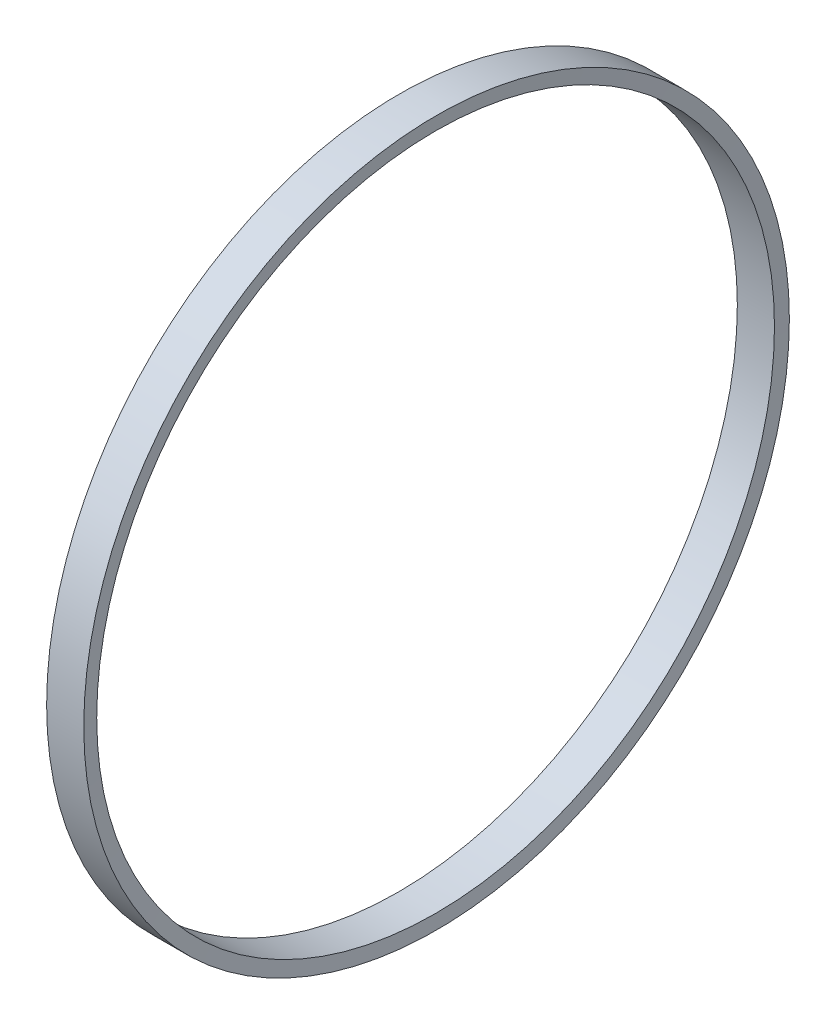
ISO-10303-21;
HEADER;
FILE_DESCRIPTION(('STEP AP214'),'2;1');
FILE_NAME('part.step','',(''),(''),'','','');
FILE_SCHEMA(('AUTOMOTIVE_DESIGN { 1 0 10303 214 1 1 1 1 }'));
ENDSEC;
DATA;
#1=APPLICATION_CONTEXT('core data for automotive mechanical design processes');
#2=APPLICATION_PROTOCOL_DEFINITION('international standard','automotive_design',2000,#1);
#3=PRODUCT_CONTEXT('',#1,'mechanical');
#4=PRODUCT('Part','Part','',(#3));
#5=PRODUCT_RELATED_PRODUCT_CATEGORY('part','',(#4));
#6=PRODUCT_DEFINITION_FORMATION('','',#4);
#7=PRODUCT_DEFINITION_CONTEXT('part definition',#1,'design');
#8=PRODUCT_DEFINITION('design','',#6,#7);
#9=PRODUCT_DEFINITION_SHAPE('','',#8);
#10=(LENGTH_UNIT() NAMED_UNIT(*) SI_UNIT(.MILLI.,.METRE.));
#11=(NAMED_UNIT(*) PLANE_ANGLE_UNIT() SI_UNIT($,.RADIAN.));
#12=(NAMED_UNIT(*) SI_UNIT($,.STERADIAN.) SOLID_ANGLE_UNIT());
#13=UNCERTAINTY_MEASURE_WITH_UNIT(LENGTH_MEASURE(1.E-05),#10,'distance_accuracy_value','');
#14=(GEOMETRIC_REPRESENTATION_CONTEXT(3) GLOBAL_UNCERTAINTY_ASSIGNED_CONTEXT((#13)) GLOBAL_UNIT_ASSIGNED_CONTEXT((#10,
#11,#12)) REPRESENTATION_CONTEXT('',''));
#15=CARTESIAN_POINT('',(0.,0.,0.));
#16=DIRECTION('',(0.,0.,1.));
#17=DIRECTION('',(1.,0.,0.));
#18=AXIS2_PLACEMENT_3D('',#15,#16,#17);
#19=CARTESIAN_POINT('',(-15.7838190834156,2.22044604925031E-13,-3.29360228641095E-13));
#20=DIRECTION('',(1.00000000000002,0.,0.));
#21=DIRECTION('',(0.,0.,-1.));
#22=AXIS2_PLACEMENT_3D('',#19,#20,#21);
#23=CONICAL_SURFACE('',#22,36.5,1.50098315671512);
#24=CARTESIAN_POINT('',(-15.6789288654999,0.,0.));
#25=DIRECTION('',(1.00000000000002,0.,0.));
#26=DIRECTION('',(0.,0.,-1.));
#27=AXIS2_PLACEMENT_3D('',#24,#25,#26);
#28=CIRCLE('',#27,38.);
#29=CARTESIAN_POINT('',(-15.6789288654997,-1.58937804102546E-13,-38.));
#30=VERTEX_POINT('',#29);
#31=EDGE_CURVE('E12',#30,#30,#28,.T.);
#32=ORIENTED_EDGE('',*,*,#31,.T.);
#33=EDGE_LOOP('',(#32));
#34=FACE_BOUND('',#33,.T.);
#35=CARTESIAN_POINT('',(-15.7838190834156,2.22044604925031E-13,-3.29360228641095E-13));
#36=DIRECTION('',(1.00000000000002,0.,0.));
#37=DIRECTION('',(0.,0.,-1.));
#38=AXIS2_PLACEMENT_3D('',#35,#36,#37);
#39=CIRCLE('',#38,36.5);
#40=CARTESIAN_POINT('',(-15.7838190834154,0.,-36.5000000000003));
#41=VERTEX_POINT('',#40);
#42=EDGE_CURVE('E57',#41,#41,#39,.T.);
#43=ORIENTED_EDGE('',*,*,#42,.F.);
#44=EDGE_LOOP('',(#43));
#45=FACE_BOUND('',#44,.T.);
#46=ADVANCED_FACE('F43',(#34,#45),#23,.F.);
#47=CARTESIAN_POINT('',(0.,0.,0.));
#48=DIRECTION('',(1.00000000000002,0.,0.));
#49=DIRECTION('',(0.,0.,-1.));
#50=AXIS2_PLACEMENT_3D('',#47,#48,#49);
#51=CYLINDRICAL_SURFACE('',#50,38.);
#52=CARTESIAN_POINT('',(-19.6789288654999,0.,0.));
#53=DIRECTION('',(1.00000000000002,0.,0.));
#54=DIRECTION('',(0.,0.,-1.));
#55=AXIS2_PLACEMENT_3D('',#52,#53,#54);
#56=CIRCLE('',#55,38.);
#57=CARTESIAN_POINT('',(-19.6789288654997,-2.28326743141618E-13,-38.));
#58=VERTEX_POINT('',#57);
#59=EDGE_CURVE('E49',#58,#58,#56,.T.);
#60=ORIENTED_EDGE('',*,*,#59,.T.);
#61=EDGE_LOOP('',(#60));
#62=FACE_BOUND('',#61,.T.);
#63=ORIENTED_EDGE('',*,*,#31,.F.);
#64=EDGE_LOOP('',(#63));
#65=FACE_BOUND('',#64,.T.);
#66=ADVANCED_FACE('F67',(#62,#65),#51,.T.);
#67=CARTESIAN_POINT('',(-19.6789288654999,0.,0.));
#68=DIRECTION('',(1.00000000000002,0.,0.));
#69=DIRECTION('',(0.,0.,-1.));
#70=AXIS2_PLACEMENT_3D('',#67,#68,#69);
#71=CONICAL_SURFACE('',#70,38.,1.50098315671512);
#72=CARTESIAN_POINT('',(-19.7838190834151,0.,0.));
#73=DIRECTION('',(1.00000000000002,0.,0.));
#74=DIRECTION('',(0.,0.,-1.));
#75=AXIS2_PLACEMENT_3D('',#72,#73,#74);
#76=CIRCLE('',#75,36.5);
#77=CARTESIAN_POINT('',(-19.7838190834149,-1.64350501568236E-13,-36.5));
#78=VERTEX_POINT('',#77);
#79=EDGE_CURVE('E53',#78,#78,#76,.T.);
#80=ORIENTED_EDGE('',*,*,#79,.T.);
#81=EDGE_LOOP('',(#80));
#82=FACE_BOUND('',#81,.T.);
#83=ORIENTED_EDGE('',*,*,#59,.F.);
#84=EDGE_LOOP('',(#83));
#85=FACE_BOUND('',#84,.T.);
#86=ADVANCED_FACE('F71',(#82,#85),#71,.T.);
#87=CARTESIAN_POINT('',(0.,0.,0.));
#88=DIRECTION('',(1.00000000000002,0.,0.));
#89=DIRECTION('',(0.,0.,-1.));
#90=AXIS2_PLACEMENT_3D('',#87,#88,#89);
#91=CYLINDRICAL_SURFACE('',#90,36.5);
#92=ORIENTED_EDGE('',*,*,#42,.T.);
#93=EDGE_LOOP('',(#92));
#94=FACE_BOUND('',#93,.T.);
#95=ORIENTED_EDGE('',*,*,#79,.F.);
#96=EDGE_LOOP('',(#95));
#97=FACE_BOUND('',#96,.T.);
#98=ADVANCED_FACE('F63',(#94,#97),#91,.F.);
#99=CLOSED_SHELL('',(#46,#66,#86,#98));
#100=MANIFOLD_SOLID_BREP('B2',#99);
#101=ADVANCED_BREP_SHAPE_REPRESENTATION('',(#18,#100),#14);
#102=SHAPE_DEFINITION_REPRESENTATION(#9,#101);
ENDSEC;
END-ISO-10303-21;
